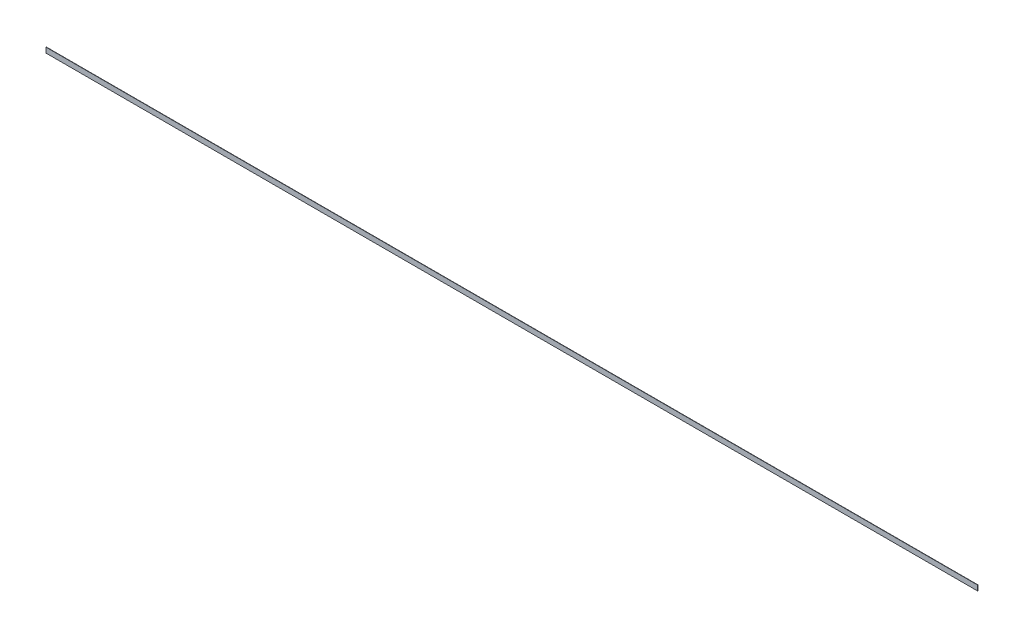
ISO-10303-21;
HEADER;
FILE_DESCRIPTION(('STEP AP214'),'2;1');
FILE_NAME('part.step','',(''),(''),'','','');
FILE_SCHEMA(('AUTOMOTIVE_DESIGN { 1 0 10303 214 1 1 1 1 }'));
ENDSEC;
DATA;
#1=APPLICATION_CONTEXT('core data for automotive mechanical design processes');
#2=APPLICATION_PROTOCOL_DEFINITION('international standard','automotive_design',2000,#1);
#3=PRODUCT_CONTEXT('',#1,'mechanical');
#4=PRODUCT('Part','Part','',(#3));
#5=PRODUCT_RELATED_PRODUCT_CATEGORY('part','',(#4));
#6=PRODUCT_DEFINITION_FORMATION('','',#4);
#7=PRODUCT_DEFINITION_CONTEXT('part definition',#1,'design');
#8=PRODUCT_DEFINITION('design','',#6,#7);
#9=PRODUCT_DEFINITION_SHAPE('','',#8);
#10=(LENGTH_UNIT() NAMED_UNIT(*) SI_UNIT(.MILLI.,.METRE.));
#11=(NAMED_UNIT(*) PLANE_ANGLE_UNIT() SI_UNIT($,.RADIAN.));
#12=(NAMED_UNIT(*) SI_UNIT($,.STERADIAN.) SOLID_ANGLE_UNIT());
#13=UNCERTAINTY_MEASURE_WITH_UNIT(LENGTH_MEASURE(1.E-05),#10,'distance_accuracy_value','');
#14=(GEOMETRIC_REPRESENTATION_CONTEXT(3) GLOBAL_UNCERTAINTY_ASSIGNED_CONTEXT((#13)) GLOBAL_UNIT_ASSIGNED_CONTEXT((#10,
#11,#12)) REPRESENTATION_CONTEXT('',''));
#15=CARTESIAN_POINT('',(0.,0.,0.));
#16=DIRECTION('',(0.,0.,1.));
#17=DIRECTION('',(1.,0.,0.));
#18=AXIS2_PLACEMENT_3D('',#15,#16,#17);
#19=CARTESIAN_POINT('',(-4572.,25.4,0.));
#20=DIRECTION('',(0.,0.,1.));
#21=DIRECTION('',(1.,0.,0.));
#22=AXIS2_PLACEMENT_3D('',#19,#20,#21);
#23=PLANE('',#22);
#24=DIRECTION('',(1.,0.,0.));
#25=VECTOR('',#24,1.);
#26=CARTESIAN_POINT('',(-4572.,25.4,0.));
#27=LINE('',#26,#25);
#28=CARTESIAN_POINT('',(-4572.,25.4,0.));
#29=VERTEX_POINT('',#28);
#30=CARTESIAN_POINT('',(4572.,25.4,0.));
#31=VERTEX_POINT('',#30);
#32=EDGE_CURVE('E19',#29,#31,#27,.T.);
#33=ORIENTED_EDGE('',*,*,#32,.F.);
#34=DIRECTION('',(0.,1.,0.));
#35=VECTOR('',#34,1.);
#36=CARTESIAN_POINT('',(-4572.,0.,0.));
#37=LINE('',#36,#35);
#38=CARTESIAN_POINT('',(-4572.,-25.4,0.));
#39=VERTEX_POINT('',#38);
#40=EDGE_CURVE('E79',#29,#39,#37,.F.);
#41=ORIENTED_EDGE('',*,*,#40,.T.);
#42=DIRECTION('',(1.,0.,0.));
#43=VECTOR('',#42,1.);
#44=CARTESIAN_POINT('',(-4572.,-25.4,0.));
#45=LINE('',#44,#43);
#46=CARTESIAN_POINT('',(4572.,-25.4,0.));
#47=VERTEX_POINT('',#46);
#48=EDGE_CURVE('E60',#47,#39,#45,.F.);
#49=ORIENTED_EDGE('',*,*,#48,.F.);
#50=DIRECTION('',(0.,1.,0.));
#51=VECTOR('',#50,1.);
#52=CARTESIAN_POINT('',(4572.,0.,0.));
#53=LINE('',#52,#51);
#54=EDGE_CURVE('E55',#31,#47,#53,.F.);
#55=ORIENTED_EDGE('',*,*,#54,.F.);
#56=EDGE_LOOP('',(#33,#41,#49,#55));
#57=FACE_BOUND('',#56,.T.);
#58=ADVANCED_FACE('F16',(#57),#23,.T.);
#59=CARTESIAN_POINT('',(-4572.,25.4,-3.175));
#60=DIRECTION('',(0.,1.,0.));
#61=DIRECTION('',(0.,0.,1.));
#62=AXIS2_PLACEMENT_3D('',#59,#60,#61);
#63=PLANE('',#62);
#64=DIRECTION('',(-1.,0.,0.));
#65=VECTOR('',#64,1.);
#66=CARTESIAN_POINT('',(-4572.,25.4,-3.175));
#67=LINE('',#66,#65);
#68=CARTESIAN_POINT('',(-4572.,25.4,-3.175));
#69=VERTEX_POINT('',#68);
#70=CARTESIAN_POINT('',(4572.,25.4,-3.175));
#71=VERTEX_POINT('',#70);
#72=EDGE_CURVE('E82',#69,#71,#67,.F.);
#73=ORIENTED_EDGE('',*,*,#72,.F.);
#74=DIRECTION('',(0.,0.,-1.));
#75=VECTOR('',#74,1.);
#76=CARTESIAN_POINT('',(-4572.,25.4,0.));
#77=LINE('',#76,#75);
#78=EDGE_CURVE('E67',#69,#29,#77,.F.);
#79=ORIENTED_EDGE('',*,*,#78,.T.);
#80=ORIENTED_EDGE('',*,*,#32,.T.);
#81=DIRECTION('',(0.,0.,-1.));
#82=VECTOR('',#81,1.);
#83=CARTESIAN_POINT('',(4572.,25.4,0.));
#84=LINE('',#83,#82);
#85=EDGE_CURVE('E62',#71,#31,#84,.F.);
#86=ORIENTED_EDGE('',*,*,#85,.F.);
#87=EDGE_LOOP('',(#73,#79,#80,#86));
#88=FACE_BOUND('',#87,.T.);
#89=ADVANCED_FACE('F64',(#88),#63,.T.);
#90=CARTESIAN_POINT('',(4572.,0.,0.));
#91=DIRECTION('',(1.,0.,0.));
#92=DIRECTION('',(0.,0.,-1.));
#93=AXIS2_PLACEMENT_3D('',#90,#91,#92);
#94=PLANE('',#93);
#95=DIRECTION('',(0.,1.,0.));
#96=VECTOR('',#95,1.);
#97=CARTESIAN_POINT('',(4572.,-25.4,-3.175));
#98=LINE('',#97,#96);
#99=CARTESIAN_POINT('',(4572.,-25.4,-3.175));
#100=VERTEX_POINT('',#99);
#101=EDGE_CURVE('E71',#71,#100,#98,.F.);
#102=ORIENTED_EDGE('',*,*,#101,.F.);
#103=ORIENTED_EDGE('',*,*,#85,.T.);
#104=ORIENTED_EDGE('',*,*,#54,.T.);
#105=DIRECTION('',(0.,0.,-1.));
#106=VECTOR('',#105,1.);
#107=CARTESIAN_POINT('',(4572.,-25.4,0.));
#108=LINE('',#107,#106);
#109=EDGE_CURVE('E73',#100,#47,#108,.F.);
#110=ORIENTED_EDGE('',*,*,#109,.F.);
#111=EDGE_LOOP('',(#102,#103,#104,#110));
#112=FACE_BOUND('',#111,.T.);
#113=ADVANCED_FACE('F69',(#112),#94,.T.);
#114=CARTESIAN_POINT('',(-4572.,-25.4,0.));
#115=DIRECTION('',(0.,-1.,0.));
#116=DIRECTION('',(0.,0.,-1.));
#117=AXIS2_PLACEMENT_3D('',#114,#115,#116);
#118=PLANE('',#117);
#119=ORIENTED_EDGE('',*,*,#48,.T.);
#120=DIRECTION('',(0.,0.,-1.));
#121=VECTOR('',#120,1.);
#122=CARTESIAN_POINT('',(-4572.,-25.4,0.));
#123=LINE('',#122,#121);
#124=CARTESIAN_POINT('',(-4572.,-25.4,-3.175));
#125=VERTEX_POINT('',#124);
#126=EDGE_CURVE('E34',#39,#125,#123,.T.);
#127=ORIENTED_EDGE('',*,*,#126,.T.);
#128=DIRECTION('',(-1.,0.,0.));
#129=VECTOR('',#128,1.);
#130=CARTESIAN_POINT('',(-4572.,-25.4,-3.175));
#131=LINE('',#130,#129);
#132=EDGE_CURVE('E25',#100,#125,#131,.T.);
#133=ORIENTED_EDGE('',*,*,#132,.F.);
#134=ORIENTED_EDGE('',*,*,#109,.T.);
#135=EDGE_LOOP('',(#119,#127,#133,#134));
#136=FACE_BOUND('',#135,.T.);
#137=ADVANCED_FACE('F88',(#136),#118,.T.);
#138=CARTESIAN_POINT('',(-4572.,0.,0.));
#139=DIRECTION('',(1.,0.,0.));
#140=DIRECTION('',(0.,0.,-1.));
#141=AXIS2_PLACEMENT_3D('',#138,#139,#140);
#142=PLANE('',#141);
#143=ORIENTED_EDGE('',*,*,#126,.F.);
#144=ORIENTED_EDGE('',*,*,#40,.F.);
#145=ORIENTED_EDGE('',*,*,#78,.F.);
#146=DIRECTION('',(0.,1.,0.));
#147=VECTOR('',#146,1.);
#148=CARTESIAN_POINT('',(-4572.,-25.4,-3.175));
#149=LINE('',#148,#147);
#150=EDGE_CURVE('E11',#125,#69,#149,.T.);
#151=ORIENTED_EDGE('',*,*,#150,.F.);
#152=EDGE_LOOP('',(#143,#144,#145,#151));
#153=FACE_BOUND('',#152,.T.);
#154=ADVANCED_FACE('F90',(#153),#142,.F.);
#155=CARTESIAN_POINT('',(-4572.,-25.4,-3.175));
#156=DIRECTION('',(0.,0.,-1.));
#157=DIRECTION('',(-1.,0.,0.));
#158=AXIS2_PLACEMENT_3D('',#155,#156,#157);
#159=PLANE('',#158);
#160=ORIENTED_EDGE('',*,*,#132,.T.);
#161=ORIENTED_EDGE('',*,*,#150,.T.);
#162=ORIENTED_EDGE('',*,*,#72,.T.);
#163=ORIENTED_EDGE('',*,*,#101,.T.);
#164=EDGE_LOOP('',(#160,#161,#162,#163));
#165=FACE_BOUND('',#164,.T.);
#166=ADVANCED_FACE('F87',(#165),#159,.T.);
#167=CLOSED_SHELL('',(#58,#89,#113,#137,#154,#166));
#168=MANIFOLD_SOLID_BREP('B1',#167);
#169=ADVANCED_BREP_SHAPE_REPRESENTATION('',(#18,#168),#14);
#170=SHAPE_DEFINITION_REPRESENTATION(#9,#169);
ENDSEC;
END-ISO-10303-21;
